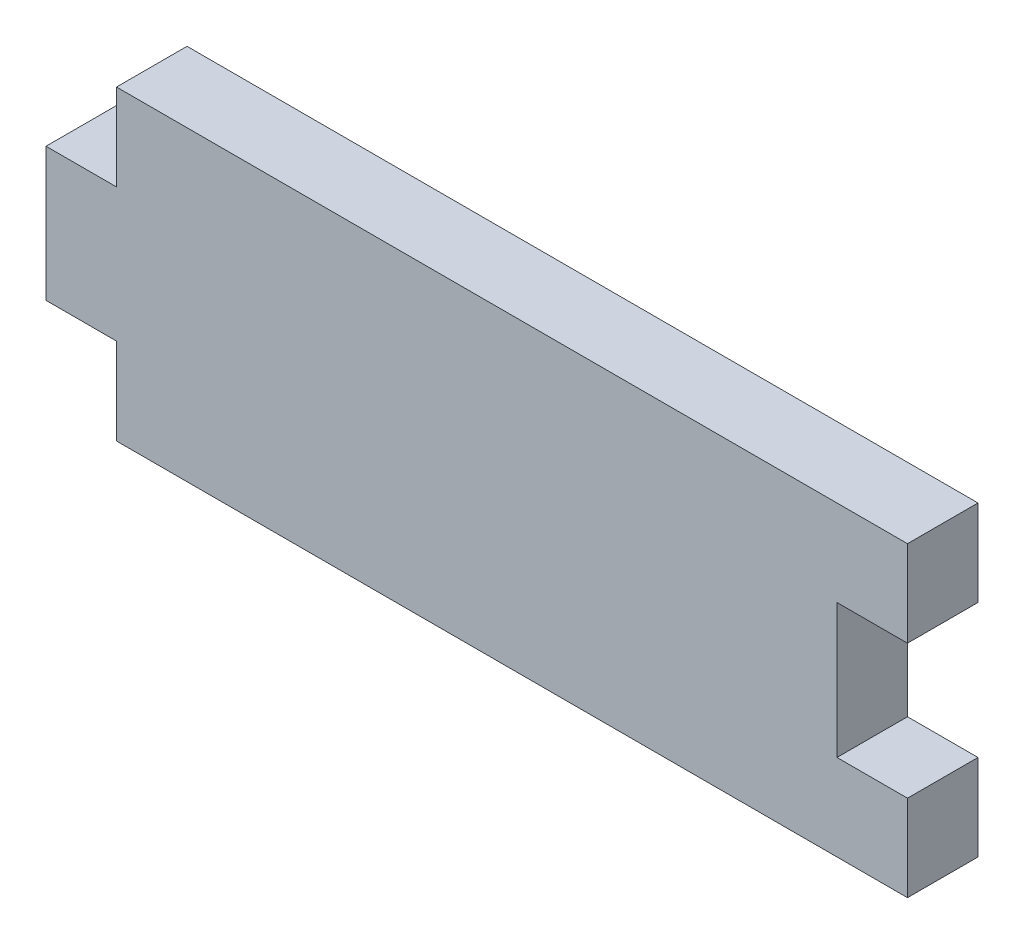
ISO-10303-21;
HEADER;
FILE_DESCRIPTION(('STEP AP214'),'2;1');
FILE_NAME('part.step','',(''),(''),'','','');
FILE_SCHEMA(('AUTOMOTIVE_DESIGN { 1 0 10303 214 1 1 1 1 }'));
ENDSEC;
DATA;
#1=APPLICATION_CONTEXT('core data for automotive mechanical design processes');
#2=APPLICATION_PROTOCOL_DEFINITION('international standard','automotive_design',2000,#1);
#3=PRODUCT_CONTEXT('',#1,'mechanical');
#4=PRODUCT('Part','Part','',(#3));
#5=PRODUCT_RELATED_PRODUCT_CATEGORY('part','',(#4));
#6=PRODUCT_DEFINITION_FORMATION('','',#4);
#7=PRODUCT_DEFINITION_CONTEXT('part definition',#1,'design');
#8=PRODUCT_DEFINITION('design','',#6,#7);
#9=PRODUCT_DEFINITION_SHAPE('','',#8);
#10=(LENGTH_UNIT() NAMED_UNIT(*) SI_UNIT(.MILLI.,.METRE.));
#11=(NAMED_UNIT(*) PLANE_ANGLE_UNIT() SI_UNIT($,.RADIAN.));
#12=(NAMED_UNIT(*) SI_UNIT($,.STERADIAN.) SOLID_ANGLE_UNIT());
#13=UNCERTAINTY_MEASURE_WITH_UNIT(LENGTH_MEASURE(1.E-05),#10,'distance_accuracy_value','');
#14=(GEOMETRIC_REPRESENTATION_CONTEXT(3) GLOBAL_UNCERTAINTY_ASSIGNED_CONTEXT((#13)) GLOBAL_UNIT_ASSIGNED_CONTEXT((#10,
#11,#12)) REPRESENTATION_CONTEXT('',''));
#15=CARTESIAN_POINT('',(0.,0.,0.));
#16=DIRECTION('',(0.,0.,1.));
#17=DIRECTION('',(1.,0.,0.));
#18=AXIS2_PLACEMENT_3D('',#15,#16,#17);
#19=CARTESIAN_POINT('',(25.8000000000019,4.37735702691278,4.6));
#20=DIRECTION('',(-1.,-3.39994070346744E-13,0.));
#21=DIRECTION('',(3.39994070346744E-13,-1.,0.));
#22=AXIS2_PLACEMENT_3D('',#19,#20,#21);
#23=PLANE('',#22);
#24=DIRECTION('',(-3.39994070346744E-13,1.,0.));
#25=VECTOR('',#24,1.);
#26=CARTESIAN_POINT('',(25.8000000000019,4.37735702691278,0.));
#27=LINE('',#26,#25);
#28=CARTESIAN_POINT('',(25.8000000000019,4.37735702691278,0.));
#29=VERTEX_POINT('',#28);
#30=CARTESIAN_POINT('',(25.8,10.,0.));
#31=VERTEX_POINT('',#30);
#32=EDGE_CURVE('E150',#29,#31,#27,.T.);
#33=ORIENTED_EDGE('',*,*,#32,.T.);
#34=DIRECTION('',(0.,0.,-1.));
#35=VECTOR('',#34,1.);
#36=CARTESIAN_POINT('',(25.8,10.,4.6));
#37=LINE('',#36,#35);
#38=CARTESIAN_POINT('',(25.8,10.,4.6));
#39=VERTEX_POINT('',#38);
#40=EDGE_CURVE('E11',#39,#31,#37,.T.);
#41=ORIENTED_EDGE('',*,*,#40,.F.);
#42=DIRECTION('',(-3.39994070346744E-13,1.,0.));
#43=VECTOR('',#42,1.);
#44=CARTESIAN_POINT('',(25.8000000000019,4.37735702691278,4.6));
#45=LINE('',#44,#43);
#46=CARTESIAN_POINT('',(25.8000000000019,4.37735702691278,4.6));
#47=VERTEX_POINT('',#46);
#48=EDGE_CURVE('E172',#47,#39,#45,.T.);
#49=ORIENTED_EDGE('',*,*,#48,.F.);
#50=DIRECTION('',(0.,0.,-1.));
#51=VECTOR('',#50,1.);
#52=CARTESIAN_POINT('',(25.8000000000019,4.37735702691278,4.6));
#53=LINE('',#52,#51);
#54=EDGE_CURVE('E146',#47,#29,#53,.T.);
#55=ORIENTED_EDGE('',*,*,#54,.T.);
#56=EDGE_LOOP('',(#33,#41,#49,#55));
#57=FACE_BOUND('',#56,.T.);
#58=ADVANCED_FACE('F30',(#57),#23,.F.);
#59=CARTESIAN_POINT('',(-25.8,10.,4.6));
#60=DIRECTION('',(0.,-1.,0.));
#61=DIRECTION('',(0.,0.,-1.));
#62=AXIS2_PLACEMENT_3D('',#59,#60,#61);
#63=PLANE('',#62);
#64=DIRECTION('',(-1.,0.,0.));
#65=VECTOR('',#64,1.);
#66=CARTESIAN_POINT('',(-25.8,10.,0.));
#67=LINE('',#66,#65);
#68=CARTESIAN_POINT('',(-25.8,10.,0.));
#69=VERTEX_POINT('',#68);
#70=EDGE_CURVE('E153',#31,#69,#67,.T.);
#71=ORIENTED_EDGE('',*,*,#70,.T.);
#72=DIRECTION('',(0.,0.,-1.));
#73=VECTOR('',#72,1.);
#74=CARTESIAN_POINT('',(-25.8,10.,4.6));
#75=LINE('',#74,#73);
#76=CARTESIAN_POINT('',(-25.8,10.,4.6));
#77=VERTEX_POINT('',#76);
#78=EDGE_CURVE('E38',#77,#69,#75,.T.);
#79=ORIENTED_EDGE('',*,*,#78,.F.);
#80=DIRECTION('',(-1.,0.,0.));
#81=VECTOR('',#80,1.);
#82=CARTESIAN_POINT('',(-25.8,10.,4.6));
#83=LINE('',#82,#81);
#84=EDGE_CURVE('E101',#39,#77,#83,.T.);
#85=ORIENTED_EDGE('',*,*,#84,.F.);
#86=ORIENTED_EDGE('',*,*,#40,.T.);
#87=EDGE_LOOP('',(#71,#79,#85,#86));
#88=FACE_BOUND('',#87,.T.);
#89=ADVANCED_FACE('F250',(#88),#63,.F.);
#90=CARTESIAN_POINT('',(-25.8,4.3551176793688,4.6));
#91=DIRECTION('',(1.,0.,0.));
#92=DIRECTION('',(0.,0.,-1.));
#93=AXIS2_PLACEMENT_3D('',#90,#91,#92);
#94=PLANE('',#93);
#95=DIRECTION('',(0.,-1.,0.));
#96=VECTOR('',#95,1.);
#97=CARTESIAN_POINT('',(-25.8,4.3551176793688,0.));
#98=LINE('',#97,#96);
#99=CARTESIAN_POINT('',(-25.8,4.3551176793688,0.));
#100=VERTEX_POINT('',#99);
#101=EDGE_CURVE('E155',#69,#100,#98,.T.);
#102=ORIENTED_EDGE('',*,*,#101,.T.);
#103=DIRECTION('',(0.,0.,-1.));
#104=VECTOR('',#103,1.);
#105=CARTESIAN_POINT('',(-25.8,4.3551176793688,4.6));
#106=LINE('',#105,#104);
#107=CARTESIAN_POINT('',(-25.8,4.3551176793688,4.6));
#108=VERTEX_POINT('',#107);
#109=EDGE_CURVE('E191',#108,#100,#106,.T.);
#110=ORIENTED_EDGE('',*,*,#109,.F.);
#111=DIRECTION('',(0.,-1.,0.));
#112=VECTOR('',#111,1.);
#113=CARTESIAN_POINT('',(-25.8,4.3551176793688,4.6));
#114=LINE('',#113,#112);
#115=EDGE_CURVE('E199',#77,#108,#114,.T.);
#116=ORIENTED_EDGE('',*,*,#115,.F.);
#117=ORIENTED_EDGE('',*,*,#78,.T.);
#118=EDGE_LOOP('',(#102,#110,#116,#117));
#119=FACE_BOUND('',#118,.T.);
#120=ADVANCED_FACE('F197',(#119),#94,.F.);
#121=CARTESIAN_POINT('',(-25.8,4.3551176793688,4.6));
#122=DIRECTION('',(0.,-1.,0.));
#123=DIRECTION('',(1.,0.,0.));
#124=AXIS2_PLACEMENT_3D('',#121,#122,#123);
#125=PLANE('',#124);
#126=DIRECTION('',(-1.,0.,0.));
#127=VECTOR('',#126,1.);
#128=CARTESIAN_POINT('',(-25.8,4.3551176793688,0.));
#129=LINE('',#128,#127);
#130=CARTESIAN_POINT('',(-30.4,4.3551176793688,0.));
#131=VERTEX_POINT('',#130);
#132=EDGE_CURVE('E157',#100,#131,#129,.T.);
#133=ORIENTED_EDGE('',*,*,#132,.T.);
#134=DIRECTION('',(0.,0.,-1.));
#135=VECTOR('',#134,1.);
#136=CARTESIAN_POINT('',(-30.4,4.3551176793688,4.6));
#137=LINE('',#136,#135);
#138=CARTESIAN_POINT('',(-30.4,4.3551176793688,4.6));
#139=VERTEX_POINT('',#138);
#140=EDGE_CURVE('E188',#139,#131,#137,.T.);
#141=ORIENTED_EDGE('',*,*,#140,.F.);
#142=DIRECTION('',(-1.,0.,0.));
#143=VECTOR('',#142,1.);
#144=CARTESIAN_POINT('',(-25.8,4.3551176793688,4.6));
#145=LINE('',#144,#143);
#146=EDGE_CURVE('E217',#108,#139,#145,.T.);
#147=ORIENTED_EDGE('',*,*,#146,.F.);
#148=ORIENTED_EDGE('',*,*,#109,.T.);
#149=EDGE_LOOP('',(#133,#141,#147,#148));
#150=FACE_BOUND('',#149,.T.);
#151=ADVANCED_FACE('F208',(#150),#125,.F.);
#152=CARTESIAN_POINT('',(-30.4,-4.3551176793688,4.6));
#153=DIRECTION('',(1.,0.,0.));
#154=DIRECTION('',(0.,0.,-1.));
#155=AXIS2_PLACEMENT_3D('',#152,#153,#154);
#156=PLANE('',#155);
#157=DIRECTION('',(0.,-1.,0.));
#158=VECTOR('',#157,1.);
#159=CARTESIAN_POINT('',(-30.4,-4.3551176793688,0.));
#160=LINE('',#159,#158);
#161=CARTESIAN_POINT('',(-30.4,-4.3551176793688,0.));
#162=VERTEX_POINT('',#161);
#163=EDGE_CURVE('E159',#131,#162,#160,.T.);
#164=ORIENTED_EDGE('',*,*,#163,.T.);
#165=DIRECTION('',(0.,0.,-1.));
#166=VECTOR('',#165,1.);
#167=CARTESIAN_POINT('',(-30.4,-4.3551176793688,4.6));
#168=LINE('',#167,#166);
#169=CARTESIAN_POINT('',(-30.4,-4.3551176793688,4.6));
#170=VERTEX_POINT('',#169);
#171=EDGE_CURVE('E185',#170,#162,#168,.T.);
#172=ORIENTED_EDGE('',*,*,#171,.F.);
#173=DIRECTION('',(0.,-1.,0.));
#174=VECTOR('',#173,1.);
#175=CARTESIAN_POINT('',(-30.4,-4.3551176793688,4.6));
#176=LINE('',#175,#174);
#177=EDGE_CURVE('E214',#139,#170,#176,.T.);
#178=ORIENTED_EDGE('',*,*,#177,.F.);
#179=ORIENTED_EDGE('',*,*,#140,.T.);
#180=EDGE_LOOP('',(#164,#172,#178,#179));
#181=FACE_BOUND('',#180,.T.);
#182=ADVANCED_FACE('F212',(#181),#156,.F.);
#183=CARTESIAN_POINT('',(-25.8,-4.3551176793688,4.6));
#184=DIRECTION('',(0.,1.,0.));
#185=DIRECTION('',(-1.,0.,0.));
#186=AXIS2_PLACEMENT_3D('',#183,#184,#185);
#187=PLANE('',#186);
#188=DIRECTION('',(1.,0.,0.));
#189=VECTOR('',#188,1.);
#190=CARTESIAN_POINT('',(-25.8,-4.3551176793688,0.));
#191=LINE('',#190,#189);
#192=CARTESIAN_POINT('',(-25.8,-4.3551176793688,0.));
#193=VERTEX_POINT('',#192);
#194=EDGE_CURVE('E161',#162,#193,#191,.T.);
#195=ORIENTED_EDGE('',*,*,#194,.T.);
#196=DIRECTION('',(0.,0.,-1.));
#197=VECTOR('',#196,1.);
#198=CARTESIAN_POINT('',(-25.8,-4.3551176793688,4.6));
#199=LINE('',#198,#197);
#200=CARTESIAN_POINT('',(-25.8,-4.3551176793688,4.6));
#201=VERTEX_POINT('',#200);
#202=EDGE_CURVE('E182',#201,#193,#199,.T.);
#203=ORIENTED_EDGE('',*,*,#202,.F.);
#204=DIRECTION('',(1.,0.,0.));
#205=VECTOR('',#204,1.);
#206=CARTESIAN_POINT('',(-25.8,-4.3551176793688,4.6));
#207=LINE('',#206,#205);
#208=EDGE_CURVE('E216',#170,#201,#207,.T.);
#209=ORIENTED_EDGE('',*,*,#208,.F.);
#210=ORIENTED_EDGE('',*,*,#171,.T.);
#211=EDGE_LOOP('',(#195,#203,#209,#210));
#212=FACE_BOUND('',#211,.T.);
#213=ADVANCED_FACE('F263',(#212),#187,.F.);
#214=CARTESIAN_POINT('',(-25.8,-10.,4.6));
#215=DIRECTION('',(1.,0.,0.));
#216=DIRECTION('',(0.,0.,-1.));
#217=AXIS2_PLACEMENT_3D('',#214,#215,#216);
#218=PLANE('',#217);
#219=DIRECTION('',(0.,-1.,0.));
#220=VECTOR('',#219,1.);
#221=CARTESIAN_POINT('',(-25.8,-10.,0.));
#222=LINE('',#221,#220);
#223=CARTESIAN_POINT('',(-25.8,-10.,0.));
#224=VERTEX_POINT('',#223);
#225=EDGE_CURVE('E163',#193,#224,#222,.T.);
#226=ORIENTED_EDGE('',*,*,#225,.T.);
#227=DIRECTION('',(0.,0.,-1.));
#228=VECTOR('',#227,1.);
#229=CARTESIAN_POINT('',(-25.8,-10.,4.6));
#230=LINE('',#229,#228);
#231=CARTESIAN_POINT('',(-25.8,-10.,4.6));
#232=VERTEX_POINT('',#231);
#233=EDGE_CURVE('E179',#232,#224,#230,.T.);
#234=ORIENTED_EDGE('',*,*,#233,.F.);
#235=DIRECTION('',(0.,-1.,0.));
#236=VECTOR('',#235,1.);
#237=CARTESIAN_POINT('',(-25.8,-10.,4.6));
#238=LINE('',#237,#236);
#239=EDGE_CURVE('E219',#201,#232,#238,.T.);
#240=ORIENTED_EDGE('',*,*,#239,.F.);
#241=ORIENTED_EDGE('',*,*,#202,.T.);
#242=EDGE_LOOP('',(#226,#234,#240,#241));
#243=FACE_BOUND('',#242,.T.);
#244=ADVANCED_FACE('F266',(#243),#218,.F.);
#245=CARTESIAN_POINT('',(-25.8,-10.,4.6));
#246=DIRECTION('',(0.,1.,0.));
#247=DIRECTION('',(0.,0.,1.));
#248=AXIS2_PLACEMENT_3D('',#245,#246,#247);
#249=PLANE('',#248);
#250=DIRECTION('',(1.,0.,0.));
#251=VECTOR('',#250,1.);
#252=CARTESIAN_POINT('',(-25.8,-10.,0.));
#253=LINE('',#252,#251);
#254=CARTESIAN_POINT('',(25.8,-10.,0.));
#255=VERTEX_POINT('',#254);
#256=EDGE_CURVE('E165',#224,#255,#253,.T.);
#257=ORIENTED_EDGE('',*,*,#256,.T.);
#258=DIRECTION('',(0.,0.,-1.));
#259=VECTOR('',#258,1.);
#260=CARTESIAN_POINT('',(25.8,-10.,4.6));
#261=LINE('',#260,#259);
#262=CARTESIAN_POINT('',(25.8,-10.,4.6));
#263=VERTEX_POINT('',#262);
#264=EDGE_CURVE('E176',#263,#255,#261,.T.);
#265=ORIENTED_EDGE('',*,*,#264,.F.);
#266=DIRECTION('',(1.,0.,0.));
#267=VECTOR('',#266,1.);
#268=CARTESIAN_POINT('',(-25.8,-10.,4.6));
#269=LINE('',#268,#267);
#270=EDGE_CURVE('E225',#232,#263,#269,.T.);
#271=ORIENTED_EDGE('',*,*,#270,.F.);
#272=ORIENTED_EDGE('',*,*,#233,.T.);
#273=EDGE_LOOP('',(#257,#265,#271,#272));
#274=FACE_BOUND('',#273,.T.);
#275=ADVANCED_FACE('F231',(#274),#249,.F.);
#276=CARTESIAN_POINT('',(25.8,-10.,4.6));
#277=DIRECTION('',(-1.,0.,0.));
#278=DIRECTION('',(0.,0.,1.));
#279=AXIS2_PLACEMENT_3D('',#276,#277,#278);
#280=PLANE('',#279);
#281=DIRECTION('',(0.,1.,0.));
#282=VECTOR('',#281,1.);
#283=CARTESIAN_POINT('',(25.8,-10.,0.));
#284=LINE('',#283,#282);
#285=CARTESIAN_POINT('',(25.8,-4.37735702691278,0.));
#286=VERTEX_POINT('',#285);
#287=EDGE_CURVE('E167',#255,#286,#284,.T.);
#288=ORIENTED_EDGE('',*,*,#287,.T.);
#289=DIRECTION('',(0.,0.,-1.));
#290=VECTOR('',#289,1.);
#291=CARTESIAN_POINT('',(25.8,-4.37735702691278,4.6));
#292=LINE('',#291,#290);
#293=CARTESIAN_POINT('',(25.8,-4.37735702691278,4.6));
#294=VERTEX_POINT('',#293);
#295=EDGE_CURVE('E141',#294,#286,#292,.T.);
#296=ORIENTED_EDGE('',*,*,#295,.F.);
#297=DIRECTION('',(0.,1.,0.));
#298=VECTOR('',#297,1.);
#299=CARTESIAN_POINT('',(25.8,-10.,4.6));
#300=LINE('',#299,#298);
#301=EDGE_CURVE('E132',#263,#294,#300,.T.);
#302=ORIENTED_EDGE('',*,*,#301,.F.);
#303=ORIENTED_EDGE('',*,*,#264,.T.);
#304=EDGE_LOOP('',(#288,#296,#302,#303));
#305=FACE_BOUND('',#304,.T.);
#306=ADVANCED_FACE('F235',(#305),#280,.F.);
#307=CARTESIAN_POINT('',(25.8,-4.37735702691278,4.6));
#308=DIRECTION('',(0.,-1.,0.));
#309=DIRECTION('',(0.,0.,-1.));
#310=AXIS2_PLACEMENT_3D('',#307,#308,#309);
#311=PLANE('',#310);
#312=DIRECTION('',(-1.,0.,0.));
#313=VECTOR('',#312,1.);
#314=CARTESIAN_POINT('',(25.8,-4.37735702691278,0.));
#315=LINE('',#314,#313);
#316=CARTESIAN_POINT('',(21.2,-4.37735702691278,0.));
#317=VERTEX_POINT('',#316);
#318=EDGE_CURVE('E140',#286,#317,#315,.T.);
#319=ORIENTED_EDGE('',*,*,#318,.T.);
#320=DIRECTION('',(0.,0.,-1.));
#321=VECTOR('',#320,1.);
#322=CARTESIAN_POINT('',(21.2,-4.37735702691278,4.6));
#323=LINE('',#322,#321);
#324=CARTESIAN_POINT('',(21.2,-4.37735702691278,4.6));
#325=VERTEX_POINT('',#324);
#326=EDGE_CURVE('E137',#325,#317,#323,.T.);
#327=ORIENTED_EDGE('',*,*,#326,.F.);
#328=DIRECTION('',(-1.,0.,0.));
#329=VECTOR('',#328,1.);
#330=CARTESIAN_POINT('',(25.8,-4.37735702691278,4.6));
#331=LINE('',#330,#329);
#332=EDGE_CURVE('E126',#294,#325,#331,.T.);
#333=ORIENTED_EDGE('',*,*,#332,.F.);
#334=ORIENTED_EDGE('',*,*,#295,.T.);
#335=EDGE_LOOP('',(#319,#327,#333,#334));
#336=FACE_BOUND('',#335,.T.);
#337=ADVANCED_FACE('F138',(#336),#311,.F.);
#338=CARTESIAN_POINT('',(21.2,-4.37735702691278,4.6));
#339=DIRECTION('',(-1.,0.,0.));
#340=DIRECTION('',(0.,-1.,0.));
#341=AXIS2_PLACEMENT_3D('',#338,#339,#340);
#342=PLANE('',#341);
#343=DIRECTION('',(0.,1.,0.));
#344=VECTOR('',#343,1.);
#345=CARTESIAN_POINT('',(21.2,-4.37735702691278,0.));
#346=LINE('',#345,#344);
#347=CARTESIAN_POINT('',(21.2,4.37735702691278,0.));
#348=VERTEX_POINT('',#347);
#349=EDGE_CURVE('E87',#317,#348,#346,.T.);
#350=ORIENTED_EDGE('',*,*,#349,.T.);
#351=DIRECTION('',(0.,0.,-1.));
#352=VECTOR('',#351,1.);
#353=CARTESIAN_POINT('',(21.2,4.37735702691278,4.6));
#354=LINE('',#353,#352);
#355=CARTESIAN_POINT('',(21.2,4.37735702691278,4.6));
#356=VERTEX_POINT('',#355);
#357=EDGE_CURVE('E142',#356,#348,#354,.T.);
#358=ORIENTED_EDGE('',*,*,#357,.F.);
#359=DIRECTION('',(0.,1.,0.));
#360=VECTOR('',#359,1.);
#361=CARTESIAN_POINT('',(21.2,-4.37735702691278,4.6));
#362=LINE('',#361,#360);
#363=EDGE_CURVE('E130',#325,#356,#362,.T.);
#364=ORIENTED_EDGE('',*,*,#363,.F.);
#365=ORIENTED_EDGE('',*,*,#326,.T.);
#366=EDGE_LOOP('',(#350,#358,#364,#365));
#367=FACE_BOUND('',#366,.T.);
#368=ADVANCED_FACE('F144',(#367),#342,.F.);
#369=CARTESIAN_POINT('',(25.8000000000019,4.37735702691278,4.6));
#370=DIRECTION('',(0.,1.,0.));
#371=DIRECTION('',(0.,0.,1.));
#372=AXIS2_PLACEMENT_3D('',#369,#370,#371);
#373=PLANE('',#372);
#374=DIRECTION('',(1.,0.,0.));
#375=VECTOR('',#374,1.);
#376=CARTESIAN_POINT('',(25.8000000000019,4.37735702691278,0.));
#377=LINE('',#376,#375);
#378=EDGE_CURVE('E93',#348,#29,#377,.T.);
#379=ORIENTED_EDGE('',*,*,#378,.T.);
#380=ORIENTED_EDGE('',*,*,#54,.F.);
#381=DIRECTION('',(1.,0.,0.));
#382=VECTOR('',#381,1.);
#383=CARTESIAN_POINT('',(25.8000000000019,4.37735702691278,4.6));
#384=LINE('',#383,#382);
#385=EDGE_CURVE('E46',#356,#47,#384,.T.);
#386=ORIENTED_EDGE('',*,*,#385,.F.);
#387=ORIENTED_EDGE('',*,*,#357,.T.);
#388=EDGE_LOOP('',(#379,#380,#386,#387));
#389=FACE_BOUND('',#388,.T.);
#390=ADVANCED_FACE('F239',(#389),#373,.F.);
#391=CARTESIAN_POINT('',(25.8,10.,4.6));
#392=DIRECTION('',(0.,0.,-1.));
#393=DIRECTION('',(-1.,0.,0.));
#394=AXIS2_PLACEMENT_3D('',#391,#392,#393);
#395=PLANE('',#394);
#396=ORIENTED_EDGE('',*,*,#48,.T.);
#397=ORIENTED_EDGE('',*,*,#84,.T.);
#398=ORIENTED_EDGE('',*,*,#115,.T.);
#399=ORIENTED_EDGE('',*,*,#146,.T.);
#400=ORIENTED_EDGE('',*,*,#177,.T.);
#401=ORIENTED_EDGE('',*,*,#208,.T.);
#402=ORIENTED_EDGE('',*,*,#239,.T.);
#403=ORIENTED_EDGE('',*,*,#270,.T.);
#404=ORIENTED_EDGE('',*,*,#301,.T.);
#405=ORIENTED_EDGE('',*,*,#332,.T.);
#406=ORIENTED_EDGE('',*,*,#363,.T.);
#407=ORIENTED_EDGE('',*,*,#385,.T.);
#408=EDGE_LOOP('',(#396,#397,#398,#399,#400,#401,#402,#403,#404,#405,#406,#407));
#409=FACE_BOUND('',#408,.T.);
#410=ADVANCED_FACE('F128',(#409),#395,.F.);
#411=CARTESIAN_POINT('',(25.8,10.,0.));
#412=DIRECTION('',(0.,0.,-1.));
#413=DIRECTION('',(-1.,0.,0.));
#414=AXIS2_PLACEMENT_3D('',#411,#412,#413);
#415=PLANE('',#414);
#416=ORIENTED_EDGE('',*,*,#32,.F.);
#417=ORIENTED_EDGE('',*,*,#378,.F.);
#418=ORIENTED_EDGE('',*,*,#349,.F.);
#419=ORIENTED_EDGE('',*,*,#318,.F.);
#420=ORIENTED_EDGE('',*,*,#287,.F.);
#421=ORIENTED_EDGE('',*,*,#256,.F.);
#422=ORIENTED_EDGE('',*,*,#225,.F.);
#423=ORIENTED_EDGE('',*,*,#194,.F.);
#424=ORIENTED_EDGE('',*,*,#163,.F.);
#425=ORIENTED_EDGE('',*,*,#132,.F.);
#426=ORIENTED_EDGE('',*,*,#101,.F.);
#427=ORIENTED_EDGE('',*,*,#70,.F.);
#428=EDGE_LOOP('',(#416,#417,#418,#419,#420,#421,#422,#423,#424,#425,#426,#427));
#429=FACE_BOUND('',#428,.T.);
#430=ADVANCED_FACE('F203',(#429),#415,.T.);
#431=CLOSED_SHELL('',(#58,#89,#120,#151,#182,#213,#244,#275,#306,#337,#368,#390,#410,#430));
#432=MANIFOLD_SOLID_BREP('B2',#431);
#433=ADVANCED_BREP_SHAPE_REPRESENTATION('',(#18,#432),#14);
#434=SHAPE_DEFINITION_REPRESENTATION(#9,#433);
ENDSEC;
END-ISO-10303-21;
